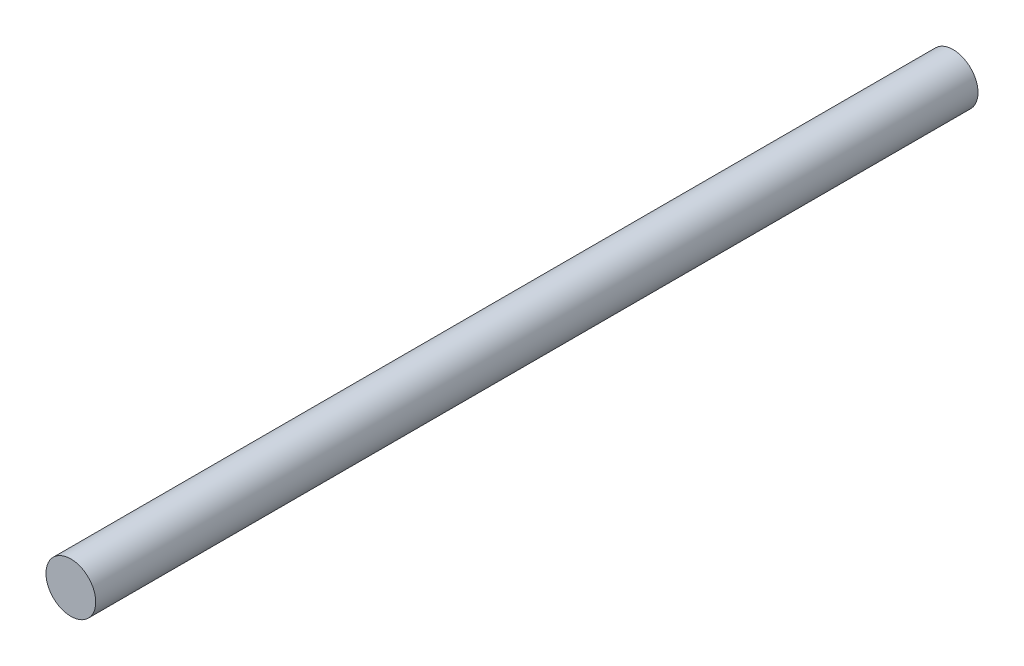
ISO-10303-21;
HEADER;
FILE_DESCRIPTION(('STEP AP214'),'2;1');
FILE_NAME('part.step','',(''),(''),'','','');
FILE_SCHEMA(('AUTOMOTIVE_DESIGN { 1 0 10303 214 1 1 1 1 }'));
ENDSEC;
DATA;
#1=APPLICATION_CONTEXT('core data for automotive mechanical design processes');
#2=APPLICATION_PROTOCOL_DEFINITION('international standard','automotive_design',2000,#1);
#3=PRODUCT_CONTEXT('',#1,'mechanical');
#4=PRODUCT('Part','Part','',(#3));
#5=PRODUCT_RELATED_PRODUCT_CATEGORY('part','',(#4));
#6=PRODUCT_DEFINITION_FORMATION('','',#4);
#7=PRODUCT_DEFINITION_CONTEXT('part definition',#1,'design');
#8=PRODUCT_DEFINITION('design','',#6,#7);
#9=PRODUCT_DEFINITION_SHAPE('','',#8);
#10=(LENGTH_UNIT() NAMED_UNIT(*) SI_UNIT(.MILLI.,.METRE.));
#11=(NAMED_UNIT(*) PLANE_ANGLE_UNIT() SI_UNIT($,.RADIAN.));
#12=(NAMED_UNIT(*) SI_UNIT($,.STERADIAN.) SOLID_ANGLE_UNIT());
#13=UNCERTAINTY_MEASURE_WITH_UNIT(LENGTH_MEASURE(1.E-05),#10,'distance_accuracy_value','');
#14=(GEOMETRIC_REPRESENTATION_CONTEXT(3) GLOBAL_UNCERTAINTY_ASSIGNED_CONTEXT((#13)) GLOBAL_UNIT_ASSIGNED_CONTEXT((#10,
#11,#12)) REPRESENTATION_CONTEXT('',''));
#15=CARTESIAN_POINT('',(0.,0.,0.));
#16=DIRECTION('',(0.,0.,1.));
#17=DIRECTION('',(1.,0.,0.));
#18=AXIS2_PLACEMENT_3D('',#15,#16,#17);
#19=CARTESIAN_POINT('',(0.,0.,99.06));
#20=DIRECTION('',(0.,0.,-1.));
#21=DIRECTION('',(-1.,0.,0.));
#22=AXIS2_PLACEMENT_3D('',#19,#20,#21);
#23=CYLINDRICAL_SURFACE('',#22,2.794);
#24=CARTESIAN_POINT('',(0.,0.,99.06));
#25=DIRECTION('',(0.,0.,1.));
#26=DIRECTION('',(1.,0.,0.));
#27=AXIS2_PLACEMENT_3D('',#24,#25,#26);
#28=CIRCLE('',#27,2.794);
#29=CARTESIAN_POINT('',(2.794,0.,99.06));
#30=VERTEX_POINT('',#29);
#31=EDGE_CURVE('E10',#30,#30,#28,.T.);
#32=ORIENTED_EDGE('',*,*,#31,.F.);
#33=EDGE_LOOP('',(#32));
#34=FACE_BOUND('',#33,.T.);
#35=CARTESIAN_POINT('',(0.,0.,0.));
#36=DIRECTION('',(0.,0.,1.));
#37=DIRECTION('',(1.,0.,0.));
#38=AXIS2_PLACEMENT_3D('',#35,#36,#37);
#39=CIRCLE('',#38,2.794);
#40=CARTESIAN_POINT('',(2.794,0.,0.));
#41=VERTEX_POINT('',#40);
#42=EDGE_CURVE('E36',#41,#41,#39,.T.);
#43=ORIENTED_EDGE('',*,*,#42,.T.);
#44=EDGE_LOOP('',(#43));
#45=FACE_BOUND('',#44,.T.);
#46=ADVANCED_FACE('F33',(#34,#45),#23,.T.);
#47=CARTESIAN_POINT('',(0.,0.,99.06));
#48=DIRECTION('',(0.,0.,1.));
#49=DIRECTION('',(1.,0.,0.));
#50=AXIS2_PLACEMENT_3D('',#47,#48,#49);
#51=PLANE('',#50);
#52=ORIENTED_EDGE('',*,*,#31,.T.);
#53=EDGE_LOOP('',(#52));
#54=FACE_BOUND('',#53,.T.);
#55=ADVANCED_FACE('F48',(#54),#51,.T.);
#56=CARTESIAN_POINT('',(0.,0.,0.));
#57=DIRECTION('',(0.,0.,1.));
#58=DIRECTION('',(1.,0.,0.));
#59=AXIS2_PLACEMENT_3D('',#56,#57,#58);
#60=PLANE('',#59);
#61=ORIENTED_EDGE('',*,*,#42,.F.);
#62=EDGE_LOOP('',(#61));
#63=FACE_BOUND('',#62,.T.);
#64=ADVANCED_FACE('F46',(#63),#60,.F.);
#65=CLOSED_SHELL('',(#46,#55,#64));
#66=MANIFOLD_SOLID_BREP('B2',#65);
#67=ADVANCED_BREP_SHAPE_REPRESENTATION('',(#18,#66),#14);
#68=SHAPE_DEFINITION_REPRESENTATION(#9,#67);
ENDSEC;
END-ISO-10303-21;
